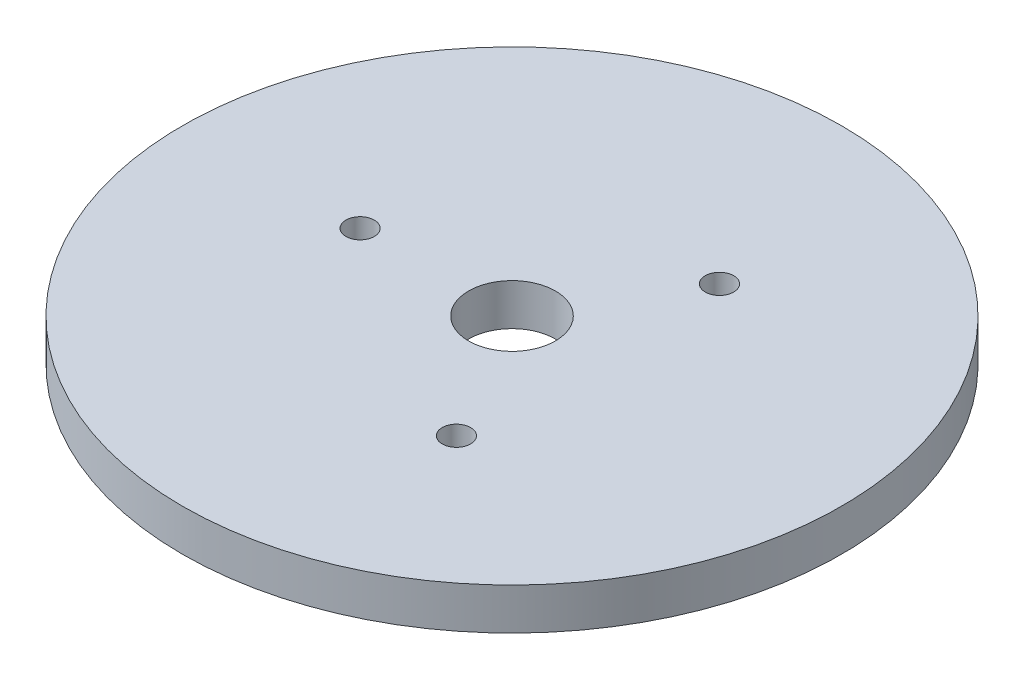
ISO-10303-21;
HEADER;
FILE_DESCRIPTION(('STEP AP214'),'2;1');
FILE_NAME('part.step','',(''),(''),'','','');
FILE_SCHEMA(('AUTOMOTIVE_DESIGN { 1 0 10303 214 1 1 1 1 }'));
ENDSEC;
DATA;
#1=APPLICATION_CONTEXT('core data for automotive mechanical design processes');
#2=APPLICATION_PROTOCOL_DEFINITION('international standard','automotive_design',2000,#1);
#3=PRODUCT_CONTEXT('',#1,'mechanical');
#4=PRODUCT('Part','Part','',(#3));
#5=PRODUCT_RELATED_PRODUCT_CATEGORY('part','',(#4));
#6=PRODUCT_DEFINITION_FORMATION('','',#4);
#7=PRODUCT_DEFINITION_CONTEXT('part definition',#1,'design');
#8=PRODUCT_DEFINITION('design','',#6,#7);
#9=PRODUCT_DEFINITION_SHAPE('','',#8);
#10=(LENGTH_UNIT() NAMED_UNIT(*) SI_UNIT(.MILLI.,.METRE.));
#11=(NAMED_UNIT(*) PLANE_ANGLE_UNIT() SI_UNIT($,.RADIAN.));
#12=(NAMED_UNIT(*) SI_UNIT($,.STERADIAN.) SOLID_ANGLE_UNIT());
#13=UNCERTAINTY_MEASURE_WITH_UNIT(LENGTH_MEASURE(1.E-05),#10,'distance_accuracy_value','');
#14=(GEOMETRIC_REPRESENTATION_CONTEXT(3) GLOBAL_UNCERTAINTY_ASSIGNED_CONTEXT((#13)) GLOBAL_UNIT_ASSIGNED_CONTEXT((#10,
#11,#12)) REPRESENTATION_CONTEXT('',''));
#15=CARTESIAN_POINT('',(0.,0.,0.));
#16=DIRECTION('',(0.,0.,1.));
#17=DIRECTION('',(1.,0.,0.));
#18=AXIS2_PLACEMENT_3D('',#15,#16,#17);
#19=CARTESIAN_POINT('',(0.,12.,0.));
#20=DIRECTION('',(0.,-1.,0.));
#21=DIRECTION('',(0.,0.,-1.));
#22=AXIS2_PLACEMENT_3D('',#19,#20,#21);
#23=CYLINDRICAL_SURFACE('',#22,95.);
#24=CARTESIAN_POINT('',(0.,12.,0.));
#25=DIRECTION('',(0.,1.,0.));
#26=DIRECTION('',(0.,0.,1.));
#27=AXIS2_PLACEMENT_3D('',#24,#25,#26);
#28=CIRCLE('',#27,95.);
#29=CARTESIAN_POINT('',(0.,12.,95.));
#30=VERTEX_POINT('',#29);
#31=EDGE_CURVE('E10',#30,#30,#28,.T.);
#32=ORIENTED_EDGE('',*,*,#31,.F.);
#33=EDGE_LOOP('',(#32));
#34=FACE_BOUND('',#33,.T.);
#35=CARTESIAN_POINT('',(0.,0.,0.));
#36=DIRECTION('',(0.,1.,0.));
#37=DIRECTION('',(0.,0.,1.));
#38=AXIS2_PLACEMENT_3D('',#35,#36,#37);
#39=CIRCLE('',#38,95.);
#40=CARTESIAN_POINT('',(0.,0.,95.));
#41=VERTEX_POINT('',#40);
#42=EDGE_CURVE('E37',#41,#41,#39,.T.);
#43=ORIENTED_EDGE('',*,*,#42,.T.);
#44=EDGE_LOOP('',(#43));
#45=FACE_BOUND('',#44,.T.);
#46=ADVANCED_FACE('F40',(#34,#45),#23,.T.);
#47=CARTESIAN_POINT('',(0.,12.,0.));
#48=DIRECTION('',(0.,1.,0.));
#49=DIRECTION('',(0.,0.,1.));
#50=AXIS2_PLACEMENT_3D('',#47,#48,#49);
#51=PLANE('',#50);
#52=CARTESIAN_POINT('',(21.8906491260524,12.,37.9157164969856));
#53=DIRECTION('',(0.,1.,0.));
#54=DIRECTION('',(0.866025403784436,0.,-0.500000000000004));
#55=AXIS2_PLACEMENT_3D('',#52,#53,#54);
#56=CIRCLE('',#55,4.09739701287143);
#57=CARTESIAN_POINT('',(25.4390990285895,12.,35.8670179905499));
#58=VERTEX_POINT('',#57);
#59=EDGE_CURVE('E70',#58,#58,#56,.T.);
#60=ORIENTED_EDGE('',*,*,#59,.F.);
#61=EDGE_LOOP('',(#60));
#62=FACE_BOUND('',#61,.T.);
#63=CARTESIAN_POINT('',(21.8906491260519,12.,-37.9157164969859));
#64=DIRECTION('',(0.,1.,0.));
#65=DIRECTION('',(-0.866025403784443,0.,-0.499999999999992));
#66=AXIS2_PLACEMENT_3D('',#63,#64,#65);
#67=CIRCLE('',#66,4.09739701287143);
#68=CARTESIAN_POINT('',(18.3421992235147,12.,-39.9644150034216));
#69=VERTEX_POINT('',#68);
#70=EDGE_CURVE('E61',#69,#69,#67,.T.);
#71=ORIENTED_EDGE('',*,*,#70,.F.);
#72=EDGE_LOOP('',(#71));
#73=FACE_BOUND('',#72,.T.);
#74=CARTESIAN_POINT('',(-43.7812982521045,12.,0.));
#75=DIRECTION('',(0.,1.,0.));
#76=DIRECTION('',(0.,0.,1.));
#77=AXIS2_PLACEMENT_3D('',#74,#75,#76);
#78=CIRCLE('',#77,4.09739701287143);
#79=CARTESIAN_POINT('',(-43.7812982521045,12.,4.09739701287143));
#80=VERTEX_POINT('',#79);
#81=EDGE_CURVE('E54',#80,#80,#78,.T.);
#82=ORIENTED_EDGE('',*,*,#81,.F.);
#83=EDGE_LOOP('',(#82));
#84=FACE_BOUND('',#83,.T.);
#85=CARTESIAN_POINT('',(0.,12.,0.));
#86=DIRECTION('',(0.,1.,0.));
#87=DIRECTION('',(0.,0.,1.));
#88=AXIS2_PLACEMENT_3D('',#85,#86,#87);
#89=CIRCLE('',#88,12.5);
#90=CARTESIAN_POINT('',(0.,12.,12.5));
#91=VERTEX_POINT('',#90);
#92=EDGE_CURVE('E50',#91,#91,#89,.T.);
#93=ORIENTED_EDGE('',*,*,#92,.F.);
#94=EDGE_LOOP('',(#93));
#95=FACE_BOUND('',#94,.T.);
#96=ORIENTED_EDGE('',*,*,#31,.T.);
#97=EDGE_LOOP('',(#96));
#98=FACE_BOUND('',#97,.T.);
#99=ADVANCED_FACE('F85',(#62,#73,#84,#95,#98),#51,.T.);
#100=CARTESIAN_POINT('',(0.,0.,0.));
#101=DIRECTION('',(0.,1.,0.));
#102=DIRECTION('',(0.,0.,1.));
#103=AXIS2_PLACEMENT_3D('',#100,#101,#102);
#104=PLANE('',#103);
#105=CARTESIAN_POINT('',(0.,0.,0.));
#106=DIRECTION('',(0.,1.,0.));
#107=DIRECTION('',(0.,0.,1.));
#108=AXIS2_PLACEMENT_3D('',#105,#106,#107);
#109=CIRCLE('',#108,12.5);
#110=CARTESIAN_POINT('',(0.,0.,12.5));
#111=VERTEX_POINT('',#110);
#112=EDGE_CURVE('E47',#111,#111,#109,.T.);
#113=ORIENTED_EDGE('',*,*,#112,.T.);
#114=EDGE_LOOP('',(#113));
#115=FACE_BOUND('',#114,.T.);
#116=ORIENTED_EDGE('',*,*,#42,.F.);
#117=EDGE_LOOP('',(#116));
#118=FACE_BOUND('',#117,.T.);
#119=ADVANCED_FACE('F84',(#115,#118),#104,.F.);
#120=CARTESIAN_POINT('',(0.,12.,0.));
#121=DIRECTION('',(0.,-1.,0.));
#122=DIRECTION('',(0.,0.,-1.));
#123=AXIS2_PLACEMENT_3D('',#120,#121,#122);
#124=CYLINDRICAL_SURFACE('',#123,12.5);
#125=ORIENTED_EDGE('',*,*,#92,.T.);
#126=EDGE_LOOP('',(#125));
#127=FACE_BOUND('',#126,.T.);
#128=ORIENTED_EDGE('',*,*,#112,.F.);
#129=EDGE_LOOP('',(#128));
#130=FACE_BOUND('',#129,.T.);
#131=ADVANCED_FACE('F91',(#127,#130),#124,.F.);
#132=CARTESIAN_POINT('',(-43.7812982521045,3.52574901806053,0.));
#133=DIRECTION('',(0.,1.,0.));
#134=DIRECTION('',(0.,0.,1.));
#135=AXIS2_PLACEMENT_3D('',#132,#133,#134);
#136=CYLINDRICAL_SURFACE('',#135,4.09739701287143);
#137=CARTESIAN_POINT('',(-43.7812982521045,3.52574901806053,0.));
#138=DIRECTION('',(0.,1.,0.));
#139=DIRECTION('',(0.,0.,1.));
#140=AXIS2_PLACEMENT_3D('',#137,#138,#139);
#141=CIRCLE('',#140,4.09739701287143);
#142=CARTESIAN_POINT('',(-43.7812982521045,3.52574901806053,4.09739701287143));
#143=VERTEX_POINT('',#142);
#144=EDGE_CURVE('E55',#143,#143,#141,.T.);
#145=ORIENTED_EDGE('',*,*,#144,.F.);
#146=EDGE_LOOP('',(#145));
#147=FACE_BOUND('',#146,.T.);
#148=ORIENTED_EDGE('',*,*,#81,.T.);
#149=EDGE_LOOP('',(#148));
#150=FACE_BOUND('',#149,.T.);
#151=ADVANCED_FACE('F96',(#147,#150),#136,.F.);
#152=CARTESIAN_POINT('',(-43.7812982521045,3.52574901806053,0.));
#153=DIRECTION('',(0.,1.,0.));
#154=DIRECTION('',(0.,0.,1.));
#155=AXIS2_PLACEMENT_3D('',#152,#153,#154);
#156=PLANE('',#155);
#157=ORIENTED_EDGE('',*,*,#144,.T.);
#158=EDGE_LOOP('',(#157));
#159=FACE_BOUND('',#158,.T.);
#160=ADVANCED_FACE('F127',(#159),#156,.T.);
#161=CARTESIAN_POINT('',(21.8906491260519,3.52574901806053,-37.9157164969859));
#162=DIRECTION('',(0.,1.,0.));
#163=DIRECTION('',(0.,0.,1.));
#164=AXIS2_PLACEMENT_3D('',#161,#162,#163);
#165=CYLINDRICAL_SURFACE('',#164,4.09739701287143);
#166=CARTESIAN_POINT('',(21.8906491260519,3.52574901806053,-37.9157164969859));
#167=DIRECTION('',(0.,1.,0.));
#168=DIRECTION('',(-0.866025403784443,0.,-0.499999999999992));
#169=AXIS2_PLACEMENT_3D('',#166,#167,#168);
#170=CIRCLE('',#169,4.09739701287143);
#171=CARTESIAN_POINT('',(18.3421992235147,3.52574901806053,-39.9644150034216));
#172=VERTEX_POINT('',#171);
#173=EDGE_CURVE('E63',#172,#172,#170,.T.);
#174=ORIENTED_EDGE('',*,*,#173,.F.);
#175=EDGE_LOOP('',(#174));
#176=FACE_BOUND('',#175,.T.);
#177=ORIENTED_EDGE('',*,*,#70,.T.);
#178=EDGE_LOOP('',(#177));
#179=FACE_BOUND('',#178,.T.);
#180=ADVANCED_FACE('F133',(#176,#179),#165,.F.);
#181=CARTESIAN_POINT('',(21.8906491260519,3.52574901806053,-37.9157164969859));
#182=DIRECTION('',(0.,1.,0.));
#183=DIRECTION('',(-0.866025403784443,0.,-0.499999999999992));
#184=AXIS2_PLACEMENT_3D('',#181,#182,#183);
#185=PLANE('',#184);
#186=ORIENTED_EDGE('',*,*,#173,.T.);
#187=EDGE_LOOP('',(#186));
#188=FACE_BOUND('',#187,.T.);
#189=ADVANCED_FACE('F77',(#188),#185,.T.);
#190=CARTESIAN_POINT('',(21.8906491260524,3.52574901806053,37.9157164969856));
#191=DIRECTION('',(0.,1.,0.));
#192=DIRECTION('',(0.,0.,1.));
#193=AXIS2_PLACEMENT_3D('',#190,#191,#192);
#194=CYLINDRICAL_SURFACE('',#193,4.09739701287143);
#195=CARTESIAN_POINT('',(21.8906491260524,3.52574901806053,37.9157164969856));
#196=DIRECTION('',(0.,1.,0.));
#197=DIRECTION('',(0.866025403784436,0.,-0.500000000000004));
#198=AXIS2_PLACEMENT_3D('',#195,#196,#197);
#199=CIRCLE('',#198,4.09739701287143);
#200=CARTESIAN_POINT('',(25.4390990285895,3.52574901806053,35.8670179905499));
#201=VERTEX_POINT('',#200);
#202=EDGE_CURVE('E59',#201,#201,#199,.T.);
#203=ORIENTED_EDGE('',*,*,#202,.F.);
#204=EDGE_LOOP('',(#203));
#205=FACE_BOUND('',#204,.T.);
#206=ORIENTED_EDGE('',*,*,#59,.T.);
#207=EDGE_LOOP('',(#206));
#208=FACE_BOUND('',#207,.T.);
#209=ADVANCED_FACE('F73',(#205,#208),#194,.F.);
#210=CARTESIAN_POINT('',(21.8906491260524,3.52574901806053,37.9157164969856));
#211=DIRECTION('',(0.,1.,0.));
#212=DIRECTION('',(0.866025403784436,0.,-0.500000000000004));
#213=AXIS2_PLACEMENT_3D('',#210,#211,#212);
#214=PLANE('',#213);
#215=ORIENTED_EDGE('',*,*,#202,.T.);
#216=EDGE_LOOP('',(#215));
#217=FACE_BOUND('',#216,.T.);
#218=ADVANCED_FACE('F71',(#217),#214,.T.);
#219=CLOSED_SHELL('',(#46,#99,#119,#131,#151,#160,#180,#189,#209,#218));
#220=MANIFOLD_SOLID_BREP('B2',#219);
#221=ADVANCED_BREP_SHAPE_REPRESENTATION('',(#18,#220),#14);
#222=SHAPE_DEFINITION_REPRESENTATION(#9,#221);
ENDSEC;
END-ISO-10303-21;
